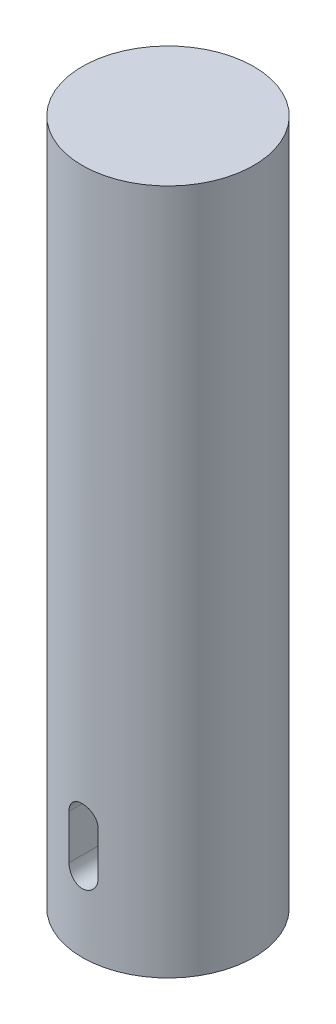
ISO-10303-21;
HEADER;
FILE_DESCRIPTION(('STEP AP214'),'2;1');
FILE_NAME('part.step','',(''),(''),'','','');
FILE_SCHEMA(('AUTOMOTIVE_DESIGN { 1 0 10303 214 1 1 1 1 }'));
ENDSEC;
DATA;
#1=APPLICATION_CONTEXT('core data for automotive mechanical design processes');
#2=APPLICATION_PROTOCOL_DEFINITION('international standard','automotive_design',2000,#1);
#3=PRODUCT_CONTEXT('',#1,'mechanical');
#4=PRODUCT('Part','Part','',(#3));
#5=PRODUCT_RELATED_PRODUCT_CATEGORY('part','',(#4));
#6=PRODUCT_DEFINITION_FORMATION('','',#4);
#7=PRODUCT_DEFINITION_CONTEXT('part definition',#1,'design');
#8=PRODUCT_DEFINITION('design','',#6,#7);
#9=PRODUCT_DEFINITION_SHAPE('','',#8);
#10=(LENGTH_UNIT() NAMED_UNIT(*) SI_UNIT(.MILLI.,.METRE.));
#11=(NAMED_UNIT(*) PLANE_ANGLE_UNIT() SI_UNIT($,.RADIAN.));
#12=(NAMED_UNIT(*) SI_UNIT($,.STERADIAN.) SOLID_ANGLE_UNIT());
#13=UNCERTAINTY_MEASURE_WITH_UNIT(LENGTH_MEASURE(1.E-05),#10,'distance_accuracy_value','');
#14=(GEOMETRIC_REPRESENTATION_CONTEXT(3) GLOBAL_UNCERTAINTY_ASSIGNED_CONTEXT((#13)) GLOBAL_UNIT_ASSIGNED_CONTEXT((#10,
#11,#12)) REPRESENTATION_CONTEXT('',''));
#15=CARTESIAN_POINT('',(0.,0.,0.));
#16=DIRECTION('',(0.,0.,1.));
#17=DIRECTION('',(1.,0.,0.));
#18=AXIS2_PLACEMENT_3D('',#15,#16,#17);
#19=CARTESIAN_POINT('',(0.,200.,0.));
#20=DIRECTION('',(0.,-1.,0.));
#21=DIRECTION('',(0.,0.,-1.));
#22=AXIS2_PLACEMENT_3D('',#19,#20,#21);
#23=CYLINDRICAL_SURFACE('',#22,25.);
#24=DIRECTION('',(0.,-1.,0.));
#25=VECTOR('',#24,1.);
#26=CARTESIAN_POINT('',(-4.23482295433691,200.,24.6387149532077));
#27=LINE('',#26,#25);
#28=CARTESIAN_POINT('',(-4.23482295433691,21.6412307753553,24.6387149532077));
#29=VERTEX_POINT('',#28);
#30=CARTESIAN_POINT('',(-4.23482295433691,34.6280211686551,24.6387149532077));
#31=VERTEX_POINT('',#30);
#32=EDGE_CURVE('E11',#29,#31,#27,.F.);
#33=ORIENTED_EDGE('',*,*,#32,.T.);
#34=CARTESIAN_POINT('',(-4.23482295433691,34.6280211686551,24.6387149532077));
#35=CARTESIAN_POINT('',(-4.23483658339663,34.7462164717334,24.6387061363336));
#36=CARTESIAN_POINT('',(-4.22987519750705,34.8644084265049,24.6395651598126));
#37=CARTESIAN_POINT('',(-4.21010222236031,35.0999297366382,24.6429548769581));
#38=CARTESIAN_POINT('',(-4.19529163634412,35.2172591786251,24.6454854003651));
#39=CARTESIAN_POINT('',(-4.15594544232956,35.4500737301937,24.6521498301211));
#40=CARTESIAN_POINT('',(-4.13142240314546,35.5655610235408,24.6562816640781));
#41=CARTESIAN_POINT('',(-4.0728450058161,35.7940254898137,24.6660256246958));
#42=CARTESIAN_POINT('',(-4.03879065363669,35.9070026643106,24.67163775043));
#43=CARTESIAN_POINT('',(-3.96139832567359,36.1296651626071,24.6841823348978));
#44=CARTESIAN_POINT('',(-3.9180602129551,36.2393504378242,24.6911148131062));
#45=CARTESIAN_POINT('',(-3.82242752857329,36.4546784263042,24.7061001845178));
#46=CARTESIAN_POINT('',(-3.77012964615477,36.5603196275102,24.714153491675));
#47=CARTESIAN_POINT('',(-3.60035942323522,36.869989907344,24.7396552006739));
#48=CARTESIAN_POINT('',(-3.46992846734002,37.0670007993087,24.7584593610983));
#49=CARTESIAN_POINT('',(-3.17703149164443,37.43812060522,24.7977503779036));
#50=CARTESIAN_POINT('',(-3.01428772311731,37.6120074452114,24.8182508553234));
#51=CARTESIAN_POINT('',(-2.66190376321031,37.9301904755911,24.8585128294447));
#52=CARTESIAN_POINT('',(-2.47225945347895,38.0744821268008,24.8782742124077));
#53=CARTESIAN_POINT('',(-2.07003841457302,38.3301568630808,24.914973631517));
#54=CARTESIAN_POINT('',(-1.85732772316592,38.4413319334836,24.9318935416682));
#55=CARTESIAN_POINT('',(-1.41592654348377,38.6262856820966,24.960849483137));
#56=CARTESIAN_POINT('',(-1.1872380370943,38.7000689890375,24.9728861189189));
#57=CARTESIAN_POINT('',(-0.72267160348529,38.8074672825301,24.9906230707575));
#58=CARTESIAN_POINT('',(-0.486882756323961,38.8414576843642,24.9963825704097));
#59=CARTESIAN_POINT('',(-0.0128769638847656,38.8694733004203,25.00111976945));
#60=CARTESIAN_POINT('',(0.225339868139951,38.8635003702871,25.0000977837275));
#61=CARTESIAN_POINT('',(0.694857421986507,38.8120517165561,24.9914339204567));
#62=CARTESIAN_POINT('',(0.92620398313404,38.7669810734717,24.9838599286469));
#63=CARTESIAN_POINT('',(1.37800655926763,38.6392462675226,24.9630179896302));
#64=CARTESIAN_POINT('',(1.59846230411093,38.5565811726596,24.9497499012623));
#65=CARTESIAN_POINT('',(2.02340399696029,38.3556343542667,24.918898427454));
#66=CARTESIAN_POINT('',(2.22780937947239,38.2371858281072,24.9012949052007));
#67=CARTESIAN_POINT('',(2.61406601489042,37.9680395170905,24.8637153198389));
#68=CARTESIAN_POINT('',(2.79591621305511,37.8173402249979,24.8437391458642));
#69=CARTESIAN_POINT('',(3.0489687600163,37.5694091801304,24.8135281503836));
#70=CARTESIAN_POINT('',(3.13050445707601,37.4824695272302,24.8033485730311));
#71=CARTESIAN_POINT('',(3.28596843561336,37.3020244425452,24.7832310189158));
#72=CARTESIAN_POINT('',(3.35989946306234,37.2085214013992,24.7732929559416));
#73=CARTESIAN_POINT('',(3.49968199671302,37.0155229518778,24.753933316162));
#74=CARTESIAN_POINT('',(3.56552811578756,36.9160236131661,24.7445120860197));
#75=CARTESIAN_POINT('',(3.68859876419986,36.7118084070221,24.726465701069));
#76=CARTESIAN_POINT('',(3.74582655001568,36.6070945299299,24.7178402460527));
#77=CARTESIAN_POINT('',(3.85138398298575,36.3929154894454,24.7016133338932));
#78=CARTESIAN_POINT('',(3.89969420508694,36.2834405809442,24.6940141216421));
#79=CARTESIAN_POINT('',(3.98688534930361,36.0607670293738,24.6800870138047));
#80=CARTESIAN_POINT('',(4.02576991487789,35.9475698444166,24.6737586271475));
#81=CARTESIAN_POINT('',(4.09379933341919,35.7183473970931,24.6625626303245));
#82=CARTESIAN_POINT('',(4.1229544371104,35.6023252502492,24.6576934832945));
#83=CARTESIAN_POINT('',(4.17134311450564,35.3682228321117,24.649553733792));
#84=CARTESIAN_POINT('',(4.19058144582278,35.250143575887,24.6462823648184));
#85=CARTESIAN_POINT('',(4.21479822612194,35.0478884584877,24.6421504610604));
#86=CARTESIAN_POINT('',(4.22231146484733,34.9640159432913,24.6408630344354));
#87=CARTESIAN_POINT('',(4.23232077049514,34.7961053451116,24.6391450211034));
#88=CARTESIAN_POINT('',(4.23482527443187,34.7120677796392,24.6387129935231));
#89=CARTESIAN_POINT('',(4.23482295433691,34.6280211686551,24.6387149532077));
#90=B_SPLINE_CURVE_WITH_KNOTS('',3,(#34,#35,#36,#37,#38,#39,#40,#41,#42,#43,#44,#45,#46,#47,#48,
#49,#50,#51,#52,#53,#54,#55,#56,#57,#58,#59,#60,#61,#62,#63,#64,#65,#66,#67,#68,#69,#70,#71,#72,
#73,#74,#75,#76,#77,#78,#79,#80,#81,#82,#83,#84,#85,#86,#87,#88,#89),.UNSPECIFIED.,.F.,.F.,(4,2,
2,2,2,2,2,2,2,2,2,2,2,2,2,2,2,2,2,2,2,2,2,2,2,2,2,4),(0.,0.35447360890638,0.708911116608497,
1.06289144023625,1.41687154230023,1.77085686590478,2.12497327507681,2.83246709538103,
3.54632831381147,4.2602989393662,4.97866397372636,5.69694005986053,6.40838371865282,
7.11979434271938,7.82392109864303,8.52806531141565,9.23554387470576,9.94305550913775,
10.3015833539831,10.659981280102,11.0186167323061,11.3771163305518,11.7363878602234,
12.0955202923261,12.4542731477878,12.8128537294988,13.0653630436457,13.317446656441),.UNSPECIFIED.);
#91=CARTESIAN_POINT('',(4.23482295433691,34.6280211686551,24.6387149532077));
#92=VERTEX_POINT('',#91);
#93=EDGE_CURVE('E106',#31,#92,#90,.T.);
#94=ORIENTED_EDGE('',*,*,#93,.T.);
#95=DIRECTION('',(0.,-1.,0.));
#96=VECTOR('',#95,1.);
#97=CARTESIAN_POINT('',(4.23482295433691,200.,24.6387149532077));
#98=LINE('',#97,#96);
#99=CARTESIAN_POINT('',(4.23482295433691,21.6412307753553,24.6387149532077));
#100=VERTEX_POINT('',#99);
#101=EDGE_CURVE('E41',#92,#100,#98,.T.);
#102=ORIENTED_EDGE('',*,*,#101,.T.);
#103=CARTESIAN_POINT('',(4.23482295433691,21.6412307753553,24.6387149532077));
#104=CARTESIAN_POINT('',(4.23483658339663,21.5230354722771,24.6387061363336));
#105=CARTESIAN_POINT('',(4.22987519750705,21.4048435175056,24.6395651598126));
#106=CARTESIAN_POINT('',(4.21010222236031,21.1693222073723,24.6429548769581));
#107=CARTESIAN_POINT('',(4.19529163634412,21.0519927653853,24.6454854003651));
#108=CARTESIAN_POINT('',(4.15594544232956,20.8191782138168,24.6521498301211));
#109=CARTESIAN_POINT('',(4.13142240314546,20.7036909204697,24.6562816640781));
#110=CARTESIAN_POINT('',(4.0728450058161,20.4752264541968,24.6660256246959));
#111=CARTESIAN_POINT('',(4.03879065363669,20.3622492796999,24.67163775043));
#112=CARTESIAN_POINT('',(3.96139832567359,20.1395867814034,24.6841823348978));
#113=CARTESIAN_POINT('',(3.91806021295509,20.0299015061863,24.6911148131062));
#114=CARTESIAN_POINT('',(3.82242752857328,19.8145735177063,24.7061001845178));
#115=CARTESIAN_POINT('',(3.77012964615476,19.7089323165003,24.7141534916751));
#116=CARTESIAN_POINT('',(3.60035942323522,19.3992620366664,24.739655200674));
#117=CARTESIAN_POINT('',(3.46992846734002,19.2022511447018,24.7584593610983));
#118=CARTESIAN_POINT('',(3.17703149164443,18.8311313387905,24.7977503779036));
#119=CARTESIAN_POINT('',(3.0142877231173,18.657244498799,24.8182508553234));
#120=CARTESIAN_POINT('',(2.6619037632103,18.3390614684193,24.8585128294447));
#121=CARTESIAN_POINT('',(2.47225945347894,18.1947698172096,24.8782742124077));
#122=CARTESIAN_POINT('',(2.07003841457301,17.9390950809296,24.914973631517));
#123=CARTESIAN_POINT('',(1.85732772316591,17.8279200105268,24.9318935416682));
#124=CARTESIAN_POINT('',(1.41592654348377,17.6429662619139,24.960849483137));
#125=CARTESIAN_POINT('',(1.18723803709429,17.569182954973,24.9728861189189));
#126=CARTESIAN_POINT('',(0.722671603485286,17.4617846614804,24.9906230707575));
#127=CARTESIAN_POINT('',(0.486882756323958,17.4277942596462,24.9963825704097));
#128=CARTESIAN_POINT('',(0.0128769638847635,17.3997786435902,25.00111976945));
#129=CARTESIAN_POINT('',(-0.225339868139953,17.4057515737233,25.0000977837275));
#130=CARTESIAN_POINT('',(-0.694857421986509,17.4572002274544,24.9914339204567));
#131=CARTESIAN_POINT('',(-0.926203983134041,17.5022708705388,24.9838599286469));
#132=CARTESIAN_POINT('',(-1.37800655926763,17.6300056764879,24.9630179896302));
#133=CARTESIAN_POINT('',(-1.59846230411094,17.7126707713508,24.9497499012623));
#134=CARTESIAN_POINT('',(-2.0234039969603,17.9136175897438,24.918898427454));
#135=CARTESIAN_POINT('',(-2.2278093794724,18.0320661159033,24.9012949052007));
#136=CARTESIAN_POINT('',(-2.61406601489042,18.30121242692,24.8637153198389));
#137=CARTESIAN_POINT('',(-2.79591621305511,18.4519117190125,24.8437391458642));
#138=CARTESIAN_POINT('',(-3.04896876001631,18.6998427638801,24.8135281503836));
#139=CARTESIAN_POINT('',(-3.13050445707601,18.7867824167802,24.8033485730311));
#140=CARTESIAN_POINT('',(-3.28596843561337,18.9672275014652,24.7832310189158));
#141=CARTESIAN_POINT('',(-3.35989946306235,19.0607305426113,24.7732929559416));
#142=CARTESIAN_POINT('',(-3.49968199671302,19.2537289921327,24.753933316162));
#143=CARTESIAN_POINT('',(-3.56552811578756,19.3532283308443,24.7445120860197));
#144=CARTESIAN_POINT('',(-3.68859876419986,19.5574435369884,24.726465701069));
#145=CARTESIAN_POINT('',(-3.74582655001568,19.6621574140805,24.7178402460527));
#146=CARTESIAN_POINT('',(-3.85138398298575,19.8763364545651,24.7016133338932));
#147=CARTESIAN_POINT('',(-3.89969420508695,19.9858113630663,24.6940141216421));
#148=CARTESIAN_POINT('',(-3.98688534930362,20.2084849146366,24.6800870138047));
#149=CARTESIAN_POINT('',(-4.02576991487789,20.3216820995939,24.6737586271475));
#150=CARTESIAN_POINT('',(-4.09379933341919,20.5509045469174,24.6625626303245));
#151=CARTESIAN_POINT('',(-4.1229544371104,20.6669266937613,24.6576934832945));
#152=CARTESIAN_POINT('',(-4.17134311450564,20.9010291118988,24.649553733792));
#153=CARTESIAN_POINT('',(-4.19058144582279,21.0191083681235,24.6462823648184));
#154=CARTESIAN_POINT('',(-4.21479822612195,21.2213634855227,24.6421504610604));
#155=CARTESIAN_POINT('',(-4.22231146484733,21.3052360007191,24.6408630344354));
#156=CARTESIAN_POINT('',(-4.23232077049514,21.4731465988988,24.6391450211034));
#157=CARTESIAN_POINT('',(-4.23482527443187,21.5571841643712,24.6387129935231));
#158=CARTESIAN_POINT('',(-4.23482295433691,21.6412307753553,24.6387149532077));
#159=B_SPLINE_CURVE_WITH_KNOTS('',3,(#103,#104,#105,#106,#107,#108,#109,#110,#111,#112,#113,
#114,#115,#116,#117,#118,#119,#120,#121,#122,#123,#124,#125,#126,#127,#128,#129,#130,#131,#132,
#133,#134,#135,#136,#137,#138,#139,#140,#141,#142,#143,#144,#145,#146,#147,#148,#149,#150,#151,
#152,#153,#154,#155,#156,#157,#158),.UNSPECIFIED.,.F.,.F.,(4,2,2,2,2,2,2,2,2,2,2,2,2,2,2,2,2,2,
2,2,2,2,2,2,2,2,2,4),(0.,0.35447360890638,0.708911116608501,1.06289144023626,1.41687154230024,
1.77085686590479,2.12497327507682,2.83246709538104,3.54632831381148,4.26029893936621,
4.97866397372637,5.69694005986053,6.40838371865282,7.11979434271938,7.82392109864303,
8.52806531141565,9.23554387470576,9.94305550913776,10.3015833539831,10.659981280102,
11.0186167323061,11.3771163305518,11.7363878602234,12.0955202923262,12.4542731477878,
12.8128537294988,13.0653630436457,13.317446656441),.UNSPECIFIED.);
#160=EDGE_CURVE('E48',#100,#29,#159,.T.);
#161=ORIENTED_EDGE('',*,*,#160,.T.);
#162=EDGE_LOOP('',(#33,#94,#102,#161));
#163=FACE_BOUND('',#162,.T.);
#164=CARTESIAN_POINT('',(0.,200.,0.));
#165=DIRECTION('',(0.,1.,0.));
#166=DIRECTION('',(0.,0.,1.));
#167=AXIS2_PLACEMENT_3D('',#164,#165,#166);
#168=CIRCLE('',#167,25.);
#169=CARTESIAN_POINT('',(0.,200.,25.));
#170=VERTEX_POINT('',#169);
#171=EDGE_CURVE('E103',#170,#170,#168,.T.);
#172=ORIENTED_EDGE('',*,*,#171,.F.);
#173=EDGE_LOOP('',(#172));
#174=FACE_BOUND('',#173,.T.);
#175=CARTESIAN_POINT('',(0.,0.,0.));
#176=DIRECTION('',(0.,1.,0.));
#177=DIRECTION('',(0.,0.,1.));
#178=AXIS2_PLACEMENT_3D('',#175,#176,#177);
#179=CIRCLE('',#178,25.);
#180=CARTESIAN_POINT('',(0.,0.,25.));
#181=VERTEX_POINT('',#180);
#182=EDGE_CURVE('E99',#181,#181,#179,.T.);
#183=ORIENTED_EDGE('',*,*,#182,.T.);
#184=EDGE_LOOP('',(#183));
#185=FACE_BOUND('',#184,.T.);
#186=ADVANCED_FACE('F33',(#163,#174,#185),#23,.T.);
#187=CARTESIAN_POINT('',(0.,200.,0.));
#188=DIRECTION('',(0.,1.,0.));
#189=DIRECTION('',(0.,0.,1.));
#190=AXIS2_PLACEMENT_3D('',#187,#188,#189);
#191=PLANE('',#190);
#192=ORIENTED_EDGE('',*,*,#171,.T.);
#193=EDGE_LOOP('',(#192));
#194=FACE_BOUND('',#193,.T.);
#195=ADVANCED_FACE('F132',(#194),#191,.T.);
#196=CARTESIAN_POINT('',(0.,0.,0.));
#197=DIRECTION('',(0.,1.,0.));
#198=DIRECTION('',(0.,0.,1.));
#199=AXIS2_PLACEMENT_3D('',#196,#197,#198);
#200=PLANE('',#199);
#201=ORIENTED_EDGE('',*,*,#182,.F.);
#202=EDGE_LOOP('',(#201));
#203=FACE_BOUND('',#202,.T.);
#204=ADVANCED_FACE('F131',(#203),#200,.F.);
#205=CARTESIAN_POINT('',(0.,21.6412307753553,15.));
#206=DIRECTION('',(0.,0.,1.));
#207=DIRECTION('',(1.,0.,0.));
#208=AXIS2_PLACEMENT_3D('',#205,#206,#207);
#209=CYLINDRICAL_SURFACE('',#208,4.23482295433691);
#210=DIRECTION('',(0.,0.,1.));
#211=VECTOR('',#210,1.);
#212=CARTESIAN_POINT('',(4.23482295433691,21.6412307753553,15.));
#213=LINE('',#212,#211);
#214=CARTESIAN_POINT('',(4.23482295433691,21.6412307753553,15.));
#215=VERTEX_POINT('',#214);
#216=EDGE_CURVE('E71',#215,#100,#213,.T.);
#217=ORIENTED_EDGE('',*,*,#216,.F.);
#218=CARTESIAN_POINT('',(0.,21.6412307753553,15.));
#219=DIRECTION('',(0.,0.,1.));
#220=DIRECTION('',(1.,0.,0.));
#221=AXIS2_PLACEMENT_3D('',#218,#219,#220);
#222=CIRCLE('',#221,4.23482295433691);
#223=CARTESIAN_POINT('',(-4.23482295433691,21.6412307753553,15.));
#224=VERTEX_POINT('',#223);
#225=EDGE_CURVE('E75',#224,#215,#222,.T.);
#226=ORIENTED_EDGE('',*,*,#225,.F.);
#227=DIRECTION('',(0.,0.,1.));
#228=VECTOR('',#227,1.);
#229=CARTESIAN_POINT('',(-4.23482295433691,21.6412307753553,15.));
#230=LINE('',#229,#228);
#231=EDGE_CURVE('E97',#224,#29,#230,.T.);
#232=ORIENTED_EDGE('',*,*,#231,.T.);
#233=ORIENTED_EDGE('',*,*,#160,.F.);
#234=EDGE_LOOP('',(#217,#226,#232,#233));
#235=FACE_BOUND('',#234,.T.);
#236=ADVANCED_FACE('F73',(#235),#209,.F.);
#237=CARTESIAN_POINT('',(-4.23482295433691,21.6412307753553,15.));
#238=DIRECTION('',(-1.,0.,0.));
#239=DIRECTION('',(0.,0.,1.));
#240=AXIS2_PLACEMENT_3D('',#237,#238,#239);
#241=PLANE('',#240);
#242=ORIENTED_EDGE('',*,*,#231,.F.);
#243=DIRECTION('',(0.,-1.,0.));
#244=VECTOR('',#243,1.);
#245=CARTESIAN_POINT('',(-4.23482295433691,21.6412307753553,15.));
#246=LINE('',#245,#244);
#247=CARTESIAN_POINT('',(-4.23482295433691,34.6280211686551,15.));
#248=VERTEX_POINT('',#247);
#249=EDGE_CURVE('E80',#248,#224,#246,.T.);
#250=ORIENTED_EDGE('',*,*,#249,.F.);
#251=DIRECTION('',(0.,0.,1.));
#252=VECTOR('',#251,1.);
#253=CARTESIAN_POINT('',(-4.23482295433691,34.6280211686551,15.));
#254=LINE('',#253,#252);
#255=EDGE_CURVE('E100',#248,#31,#254,.T.);
#256=ORIENTED_EDGE('',*,*,#255,.T.);
#257=ORIENTED_EDGE('',*,*,#32,.F.);
#258=EDGE_LOOP('',(#242,#250,#256,#257));
#259=FACE_BOUND('',#258,.T.);
#260=ADVANCED_FACE('F124',(#259),#241,.F.);
#261=CARTESIAN_POINT('',(0.,34.6280211686551,15.));
#262=DIRECTION('',(0.,0.,1.));
#263=DIRECTION('',(1.,0.,0.));
#264=AXIS2_PLACEMENT_3D('',#261,#262,#263);
#265=CYLINDRICAL_SURFACE('',#264,4.23482295433691);
#266=ORIENTED_EDGE('',*,*,#255,.F.);
#267=CARTESIAN_POINT('',(0.,34.6280211686551,15.));
#268=DIRECTION('',(0.,0.,1.));
#269=DIRECTION('',(1.,0.,0.));
#270=AXIS2_PLACEMENT_3D('',#267,#268,#269);
#271=CIRCLE('',#270,4.23482295433691);
#272=CARTESIAN_POINT('',(4.23482295433691,34.6280211686551,15.));
#273=VERTEX_POINT('',#272);
#274=EDGE_CURVE('E89',#273,#248,#271,.T.);
#275=ORIENTED_EDGE('',*,*,#274,.F.);
#276=DIRECTION('',(0.,0.,1.));
#277=VECTOR('',#276,1.);
#278=CARTESIAN_POINT('',(4.23482295433691,34.6280211686551,15.));
#279=LINE('',#278,#277);
#280=EDGE_CURVE('E79',#273,#92,#279,.T.);
#281=ORIENTED_EDGE('',*,*,#280,.T.);
#282=ORIENTED_EDGE('',*,*,#93,.F.);
#283=EDGE_LOOP('',(#266,#275,#281,#282));
#284=FACE_BOUND('',#283,.T.);
#285=ADVANCED_FACE('F119',(#284),#265,.F.);
#286=CARTESIAN_POINT('',(4.23482295433691,21.6412307753553,15.));
#287=DIRECTION('',(1.,0.,0.));
#288=DIRECTION('',(0.,0.,-1.));
#289=AXIS2_PLACEMENT_3D('',#286,#287,#288);
#290=PLANE('',#289);
#291=ORIENTED_EDGE('',*,*,#280,.F.);
#292=DIRECTION('',(0.,1.,0.));
#293=VECTOR('',#292,1.);
#294=CARTESIAN_POINT('',(4.23482295433691,21.6412307753553,15.));
#295=LINE('',#294,#293);
#296=EDGE_CURVE('E83',#215,#273,#295,.T.);
#297=ORIENTED_EDGE('',*,*,#296,.F.);
#298=ORIENTED_EDGE('',*,*,#216,.T.);
#299=ORIENTED_EDGE('',*,*,#101,.F.);
#300=EDGE_LOOP('',(#291,#297,#298,#299));
#301=FACE_BOUND('',#300,.T.);
#302=ADVANCED_FACE('F84',(#301),#290,.F.);
#303=CARTESIAN_POINT('',(0.,21.6412307753553,15.));
#304=DIRECTION('',(0.,0.,1.));
#305=DIRECTION('',(1.,0.,0.));
#306=AXIS2_PLACEMENT_3D('',#303,#304,#305);
#307=PLANE('',#306);
#308=ORIENTED_EDGE('',*,*,#225,.T.);
#309=ORIENTED_EDGE('',*,*,#296,.T.);
#310=ORIENTED_EDGE('',*,*,#274,.T.);
#311=ORIENTED_EDGE('',*,*,#249,.T.);
#312=EDGE_LOOP('',(#308,#309,#310,#311));
#313=FACE_BOUND('',#312,.T.);
#314=ADVANCED_FACE('F91',(#313),#307,.T.);
#315=CLOSED_SHELL('',(#186,#195,#204,#236,#260,#285,#302,#314));
#316=MANIFOLD_SOLID_BREP('B2',#315);
#317=ADVANCED_BREP_SHAPE_REPRESENTATION('',(#18,#316),#14);
#318=SHAPE_DEFINITION_REPRESENTATION(#9,#317);
ENDSEC;
END-ISO-10303-21;
